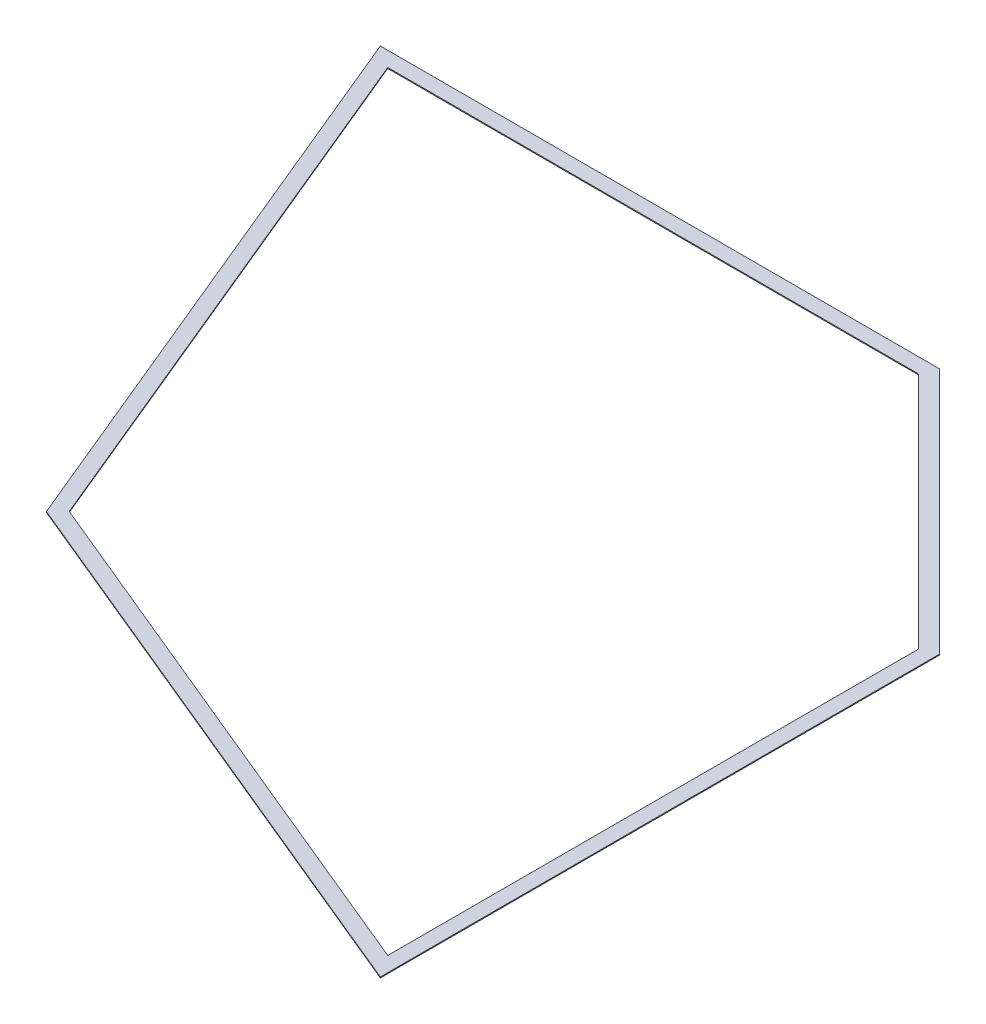
ISO-10303-21;
HEADER;
FILE_DESCRIPTION(('STEP AP214'),'2;1');
FILE_NAME('part.step','',(''),(''),'','','');
FILE_SCHEMA(('AUTOMOTIVE_DESIGN { 1 0 10303 214 1 1 1 1 }'));
ENDSEC;
DATA;
#1=APPLICATION_CONTEXT('core data for automotive mechanical design processes');
#2=APPLICATION_PROTOCOL_DEFINITION('international standard','automotive_design',2000,#1);
#3=PRODUCT_CONTEXT('',#1,'mechanical');
#4=PRODUCT('Part','Part','',(#3));
#5=PRODUCT_RELATED_PRODUCT_CATEGORY('part','',(#4));
#6=PRODUCT_DEFINITION_FORMATION('','',#4);
#7=PRODUCT_DEFINITION_CONTEXT('part definition',#1,'design');
#8=PRODUCT_DEFINITION('design','',#6,#7);
#9=PRODUCT_DEFINITION_SHAPE('','',#8);
#10=(LENGTH_UNIT() NAMED_UNIT(*) SI_UNIT(.MILLI.,.METRE.));
#11=(NAMED_UNIT(*) PLANE_ANGLE_UNIT() SI_UNIT($,.RADIAN.));
#12=(NAMED_UNIT(*) SI_UNIT($,.STERADIAN.) SOLID_ANGLE_UNIT());
#13=UNCERTAINTY_MEASURE_WITH_UNIT(LENGTH_MEASURE(1.E-05),#10,'distance_accuracy_value','');
#14=(GEOMETRIC_REPRESENTATION_CONTEXT(3) GLOBAL_UNCERTAINTY_ASSIGNED_CONTEXT((#13)) GLOBAL_UNIT_ASSIGNED_CONTEXT((#10,
#11,#12)) REPRESENTATION_CONTEXT('',''));
#15=CARTESIAN_POINT('',(0.,0.,0.));
#16=DIRECTION('',(0.,0.,1.));
#17=DIRECTION('',(1.,0.,0.));
#18=AXIS2_PLACEMENT_3D('',#15,#16,#17);
#19=CARTESIAN_POINT('',(0.,3.175,0.));
#20=DIRECTION('',(0.,-1.,0.));
#21=DIRECTION('',(0.,0.,-1.));
#22=AXIS2_PLACEMENT_3D('',#19,#20,#21);
#23=PLANE('',#22);
#24=DIRECTION('',(-1.,0.,0.));
#25=VECTOR('',#24,1.);
#26=CARTESIAN_POINT('',(-2936.30146633762,3.175,187.325));
#27=LINE('',#26,#25);
#28=CARTESIAN_POINT('',(-1029.49970440487,3.175,187.325));
#29=VERTEX_POINT('',#28);
#30=CARTESIAN_POINT('',(-2936.30146633762,3.175,187.325));
#31=VERTEX_POINT('',#30);
#32=EDGE_CURVE('E199',#29,#31,#27,.T.);
#33=ORIENTED_EDGE('',*,*,#32,.T.);
#34=DIRECTION('',(0.382683432365089,0.,0.923879532511287));
#35=VECTOR('',#34,1.);
#36=CARTESIAN_POINT('',(-2131.14490066957,3.175,2131.14490066957));
#37=LINE('',#36,#35);
#38=CARTESIAN_POINT('',(-2131.14490066957,3.175,2131.14490066957));
#39=VERTEX_POINT('',#38);
#40=EDGE_CURVE('E203',#31,#39,#37,.T.);
#41=ORIENTED_EDGE('',*,*,#40,.T.);
#42=DIRECTION('',(0.923879532511287,0.,0.38268343236509));
#43=VECTOR('',#42,1.);
#44=CARTESIAN_POINT('',(-187.325000000005,3.175,2936.30146633762));
#45=LINE('',#44,#43);
#46=CARTESIAN_POINT('',(-187.325000000005,3.175,2936.30146633762));
#47=VERTEX_POINT('',#46);
#48=EDGE_CURVE('E207',#39,#47,#45,.T.);
#49=ORIENTED_EDGE('',*,*,#48,.T.);
#50=DIRECTION('',(0.,0.,-1.));
#51=VECTOR('',#50,1.);
#52=CARTESIAN_POINT('',(-187.325000000005,3.175,1029.49970440487));
#53=LINE('',#52,#51);
#54=CARTESIAN_POINT('',(-187.325000000005,3.175,1029.49970440487));
#55=VERTEX_POINT('',#54);
#56=EDGE_CURVE('E210',#47,#55,#53,.T.);
#57=ORIENTED_EDGE('',*,*,#56,.T.);
#58=DIRECTION('',(-0.707106781186546,0.,-0.707106781186549));
#59=VECTOR('',#58,1.);
#60=CARTESIAN_POINT('',(-1029.49970440487,3.175,187.325));
#61=LINE('',#60,#59);
#62=EDGE_CURVE('E213',#55,#29,#61,.T.);
#63=ORIENTED_EDGE('',*,*,#62,.T.);
#64=EDGE_LOOP('',(#33,#41,#49,#57,#63));
#65=FACE_BOUND('',#64,.T.);
#66=DIRECTION('',(-0.707106781186546,0.,-0.707106781186549));
#67=VECTOR('',#66,1.);
#68=CARTESIAN_POINT('',(-1050.54175337342,3.175,238.125));
#69=LINE('',#68,#67);
#70=CARTESIAN_POINT('',(-238.125000000005,3.175,1050.54175337342));
#71=VERTEX_POINT('',#70);
#72=CARTESIAN_POINT('',(-1050.54175337342,3.175,238.125));
#73=VERTEX_POINT('',#72);
#74=EDGE_CURVE('E140',#71,#73,#69,.T.);
#75=ORIENTED_EDGE('',*,*,#74,.F.);
#76=DIRECTION('',(0.,0.,-1.));
#77=VECTOR('',#76,1.);
#78=CARTESIAN_POINT('',(-238.125000000005,3.175,1050.54175337342));
#79=LINE('',#78,#77);
#80=CARTESIAN_POINT('',(-238.125000000005,3.175,2860.27389359421));
#81=VERTEX_POINT('',#80);
#82=EDGE_CURVE('E173',#81,#71,#79,.T.);
#83=ORIENTED_EDGE('',*,*,#82,.F.);
#84=DIRECTION('',(0.923879532511287,0.,0.38268343236509));
#85=VECTOR('',#84,1.);
#86=CARTESIAN_POINT('',(-238.125000000005,3.175,2860.27389359421));
#87=LINE('',#86,#85);
#88=CARTESIAN_POINT('',(-2092.26426394128,3.175,2092.26426394127));
#89=VERTEX_POINT('',#88);
#90=EDGE_CURVE('E168',#89,#81,#87,.T.);
#91=ORIENTED_EDGE('',*,*,#90,.F.);
#92=DIRECTION('',(0.382683432365089,0.,0.923879532511287));
#93=VECTOR('',#92,1.);
#94=CARTESIAN_POINT('',(-2092.26426394128,3.175,2092.26426394127));
#95=LINE('',#94,#93);
#96=CARTESIAN_POINT('',(-2860.27389359422,3.175,238.125));
#97=VERTEX_POINT('',#96);
#98=EDGE_CURVE('E163',#97,#89,#95,.T.);
#99=ORIENTED_EDGE('',*,*,#98,.F.);
#100=DIRECTION('',(-1.,0.,0.));
#101=VECTOR('',#100,1.);
#102=CARTESIAN_POINT('',(-2860.27389359422,3.175,238.125));
#103=LINE('',#102,#101);
#104=EDGE_CURVE('E149',#73,#97,#103,.T.);
#105=ORIENTED_EDGE('',*,*,#104,.F.);
#106=EDGE_LOOP('',(#75,#83,#91,#99,#105));
#107=FACE_BOUND('',#106,.T.);
#108=ADVANCED_FACE('F42',(#65,#107),#23,.F.);
#109=CARTESIAN_POINT('',(0.,0.,0.));
#110=DIRECTION('',(0.,-1.,0.));
#111=DIRECTION('',(0.,0.,-1.));
#112=AXIS2_PLACEMENT_3D('',#109,#110,#111);
#113=PLANE('',#112);
#114=DIRECTION('',(-1.,0.,0.));
#115=VECTOR('',#114,1.);
#116=CARTESIAN_POINT('',(-2936.30146633762,0.,187.325));
#117=LINE('',#116,#115);
#118=CARTESIAN_POINT('',(-1029.49970440487,0.,187.325));
#119=VERTEX_POINT('',#118);
#120=CARTESIAN_POINT('',(-2936.30146633762,0.,187.325));
#121=VERTEX_POINT('',#120);
#122=EDGE_CURVE('E158',#119,#121,#117,.T.);
#123=ORIENTED_EDGE('',*,*,#122,.F.);
#124=DIRECTION('',(-0.707106781186546,0.,-0.707106781186549));
#125=VECTOR('',#124,1.);
#126=CARTESIAN_POINT('',(-1029.49970440487,0.,187.325));
#127=LINE('',#126,#125);
#128=CARTESIAN_POINT('',(-187.325000000005,0.,1029.49970440487));
#129=VERTEX_POINT('',#128);
#130=EDGE_CURVE('E204',#129,#119,#127,.T.);
#131=ORIENTED_EDGE('',*,*,#130,.F.);
#132=DIRECTION('',(0.,0.,-1.));
#133=VECTOR('',#132,1.);
#134=CARTESIAN_POINT('',(-187.325000000005,0.,1029.49970440487));
#135=LINE('',#134,#133);
#136=CARTESIAN_POINT('',(-187.325000000005,0.,2936.30146633762));
#137=VERTEX_POINT('',#136);
#138=EDGE_CURVE('E226',#137,#129,#135,.T.);
#139=ORIENTED_EDGE('',*,*,#138,.F.);
#140=DIRECTION('',(0.923879532511287,0.,0.38268343236509));
#141=VECTOR('',#140,1.);
#142=CARTESIAN_POINT('',(-187.325000000005,0.,2936.30146633762));
#143=LINE('',#142,#141);
#144=CARTESIAN_POINT('',(-2131.14490066957,0.,2131.14490066957));
#145=VERTEX_POINT('',#144);
#146=EDGE_CURVE('E223',#145,#137,#143,.T.);
#147=ORIENTED_EDGE('',*,*,#146,.F.);
#148=DIRECTION('',(0.382683432365089,0.,0.923879532511287));
#149=VECTOR('',#148,1.);
#150=CARTESIAN_POINT('',(-2131.14490066957,0.,2131.14490066957));
#151=LINE('',#150,#149);
#152=EDGE_CURVE('E220',#121,#145,#151,.T.);
#153=ORIENTED_EDGE('',*,*,#152,.F.);
#154=EDGE_LOOP('',(#123,#131,#139,#147,#153));
#155=FACE_BOUND('',#154,.T.);
#156=DIRECTION('',(0.,0.,-1.));
#157=VECTOR('',#156,1.);
#158=CARTESIAN_POINT('',(-238.125000000005,0.,1050.54175337342));
#159=LINE('',#158,#157);
#160=CARTESIAN_POINT('',(-238.125000000005,0.,2860.27389359421));
#161=VERTEX_POINT('',#160);
#162=CARTESIAN_POINT('',(-238.125000000005,0.,1050.54175337342));
#163=VERTEX_POINT('',#162);
#164=EDGE_CURVE('E150',#161,#163,#159,.T.);
#165=ORIENTED_EDGE('',*,*,#164,.T.);
#166=DIRECTION('',(-0.707106781186546,0.,-0.707106781186549));
#167=VECTOR('',#166,1.);
#168=CARTESIAN_POINT('',(-1050.54175337342,0.,238.125));
#169=LINE('',#168,#167);
#170=CARTESIAN_POINT('',(-1050.54175337342,0.,238.125));
#171=VERTEX_POINT('',#170);
#172=EDGE_CURVE('E72',#163,#171,#169,.T.);
#173=ORIENTED_EDGE('',*,*,#172,.T.);
#174=DIRECTION('',(-1.,0.,0.));
#175=VECTOR('',#174,1.);
#176=CARTESIAN_POINT('',(-2860.27389359422,0.,238.125));
#177=LINE('',#176,#175);
#178=CARTESIAN_POINT('',(-2860.27389359422,0.,238.125));
#179=VERTEX_POINT('',#178);
#180=EDGE_CURVE('E156',#171,#179,#177,.T.);
#181=ORIENTED_EDGE('',*,*,#180,.T.);
#182=DIRECTION('',(0.382683432365089,0.,0.923879532511287));
#183=VECTOR('',#182,1.);
#184=CARTESIAN_POINT('',(-2092.26426394128,0.,2092.26426394127));
#185=LINE('',#184,#183);
#186=CARTESIAN_POINT('',(-2092.26426394128,0.,2092.26426394127));
#187=VERTEX_POINT('',#186);
#188=EDGE_CURVE('E179',#179,#187,#185,.T.);
#189=ORIENTED_EDGE('',*,*,#188,.T.);
#190=DIRECTION('',(0.923879532511287,0.,0.38268343236509));
#191=VECTOR('',#190,1.);
#192=CARTESIAN_POINT('',(-238.125000000005,0.,2860.27389359421));
#193=LINE('',#192,#191);
#194=EDGE_CURVE('E183',#187,#161,#193,.T.);
#195=ORIENTED_EDGE('',*,*,#194,.T.);
#196=EDGE_LOOP('',(#165,#173,#181,#189,#195));
#197=FACE_BOUND('',#196,.T.);
#198=ADVANCED_FACE('F253',(#155,#197),#113,.T.);
#199=CARTESIAN_POINT('',(-2936.30146633762,3.175,187.325));
#200=DIRECTION('',(0.,0.,1.));
#201=DIRECTION('',(1.,0.,0.));
#202=AXIS2_PLACEMENT_3D('',#199,#200,#201);
#203=PLANE('',#202);
#204=ORIENTED_EDGE('',*,*,#122,.T.);
#205=DIRECTION('',(0.,-1.,0.));
#206=VECTOR('',#205,1.);
#207=CARTESIAN_POINT('',(-2936.30146633762,3.175,187.325));
#208=LINE('',#207,#206);
#209=EDGE_CURVE('E11',#31,#121,#208,.T.);
#210=ORIENTED_EDGE('',*,*,#209,.F.);
#211=ORIENTED_EDGE('',*,*,#32,.F.);
#212=DIRECTION('',(0.,-1.,0.));
#213=VECTOR('',#212,1.);
#214=CARTESIAN_POINT('',(-1029.49970440487,3.175,187.325));
#215=LINE('',#214,#213);
#216=EDGE_CURVE('E216',#29,#119,#215,.T.);
#217=ORIENTED_EDGE('',*,*,#216,.T.);
#218=EDGE_LOOP('',(#204,#210,#211,#217));
#219=FACE_BOUND('',#218,.T.);
#220=ADVANCED_FACE('F44',(#219),#203,.F.);
#221=CARTESIAN_POINT('',(-2131.14490066957,3.175,2131.14490066957));
#222=DIRECTION('',(0.923879532511287,0.,-0.382683432365089));
#223=DIRECTION('',(-0.382683432365089,0.,-0.923879532511287));
#224=AXIS2_PLACEMENT_3D('',#221,#222,#223);
#225=PLANE('',#224);
#226=ORIENTED_EDGE('',*,*,#152,.T.);
#227=DIRECTION('',(0.,-1.,0.));
#228=VECTOR('',#227,1.);
#229=CARTESIAN_POINT('',(-2131.14490066957,3.175,2131.14490066957));
#230=LINE('',#229,#228);
#231=EDGE_CURVE('E51',#39,#145,#230,.T.);
#232=ORIENTED_EDGE('',*,*,#231,.F.);
#233=ORIENTED_EDGE('',*,*,#40,.F.);
#234=ORIENTED_EDGE('',*,*,#209,.T.);
#235=EDGE_LOOP('',(#226,#232,#233,#234));
#236=FACE_BOUND('',#235,.T.);
#237=ADVANCED_FACE('F267',(#236),#225,.F.);
#238=CARTESIAN_POINT('',(-187.325000000005,3.175,2936.30146633762));
#239=DIRECTION('',(0.382683432365089,0.,-0.923879532511287));
#240=DIRECTION('',(-0.923879532511287,0.,-0.382683432365089));
#241=AXIS2_PLACEMENT_3D('',#238,#239,#240);
#242=PLANE('',#241);
#243=ORIENTED_EDGE('',*,*,#146,.T.);
#244=DIRECTION('',(0.,-1.,0.));
#245=VECTOR('',#244,1.);
#246=CARTESIAN_POINT('',(-187.325000000005,3.175,2936.30146633762));
#247=LINE('',#246,#245);
#248=EDGE_CURVE('E238',#47,#137,#247,.T.);
#249=ORIENTED_EDGE('',*,*,#248,.F.);
#250=ORIENTED_EDGE('',*,*,#48,.F.);
#251=ORIENTED_EDGE('',*,*,#231,.T.);
#252=EDGE_LOOP('',(#243,#249,#250,#251));
#253=FACE_BOUND('',#252,.T.);
#254=ADVANCED_FACE('F247',(#253),#242,.F.);
#255=CARTESIAN_POINT('',(-187.325000000005,3.175,1029.49970440487));
#256=DIRECTION('',(-1.,0.,0.));
#257=DIRECTION('',(0.,0.,1.));
#258=AXIS2_PLACEMENT_3D('',#255,#256,#257);
#259=PLANE('',#258);
#260=ORIENTED_EDGE('',*,*,#138,.T.);
#261=DIRECTION('',(0.,-1.,0.));
#262=VECTOR('',#261,1.);
#263=CARTESIAN_POINT('',(-187.325000000005,3.175,1029.49970440487));
#264=LINE('',#263,#262);
#265=EDGE_CURVE('E234',#55,#129,#264,.T.);
#266=ORIENTED_EDGE('',*,*,#265,.F.);
#267=ORIENTED_EDGE('',*,*,#56,.F.);
#268=ORIENTED_EDGE('',*,*,#248,.T.);
#269=EDGE_LOOP('',(#260,#266,#267,#268));
#270=FACE_BOUND('',#269,.T.);
#271=ADVANCED_FACE('F258',(#270),#259,.F.);
#272=CARTESIAN_POINT('',(-1029.49970440487,3.175,187.325));
#273=DIRECTION('',(-0.707106781186549,0.,0.707106781186546));
#274=DIRECTION('',(0.707106781186546,0.,0.707106781186549));
#275=AXIS2_PLACEMENT_3D('',#272,#273,#274);
#276=PLANE('',#275);
#277=ORIENTED_EDGE('',*,*,#130,.T.);
#278=ORIENTED_EDGE('',*,*,#216,.F.);
#279=ORIENTED_EDGE('',*,*,#62,.F.);
#280=ORIENTED_EDGE('',*,*,#265,.T.);
#281=EDGE_LOOP('',(#277,#278,#279,#280));
#282=FACE_BOUND('',#281,.T.);
#283=ADVANCED_FACE('F262',(#282),#276,.F.);
#284=CARTESIAN_POINT('',(-1050.54175337342,3.175,238.125));
#285=DIRECTION('',(-0.707106781186548,0.,0.707106781186546));
#286=DIRECTION('',(0.707106781186547,0.,0.707106781186549));
#287=AXIS2_PLACEMENT_3D('',#284,#285,#286);
#288=PLANE('',#287);
#289=ORIENTED_EDGE('',*,*,#172,.F.);
#290=DIRECTION('',(0.,-1.,0.));
#291=VECTOR('',#290,1.);
#292=CARTESIAN_POINT('',(-238.125000000005,3.175,1050.54175337342));
#293=LINE('',#292,#291);
#294=EDGE_CURVE('E144',#71,#163,#293,.T.);
#295=ORIENTED_EDGE('',*,*,#294,.F.);
#296=ORIENTED_EDGE('',*,*,#74,.T.);
#297=DIRECTION('',(0.,-1.,0.));
#298=VECTOR('',#297,1.);
#299=CARTESIAN_POINT('',(-1050.54175337342,3.175,238.125));
#300=LINE('',#299,#298);
#301=EDGE_CURVE('E143',#73,#171,#300,.T.);
#302=ORIENTED_EDGE('',*,*,#301,.T.);
#303=EDGE_LOOP('',(#289,#295,#296,#302));
#304=FACE_BOUND('',#303,.T.);
#305=ADVANCED_FACE('F142',(#304),#288,.T.);
#306=CARTESIAN_POINT('',(-2860.27389359422,3.175,238.125));
#307=DIRECTION('',(0.,0.,1.));
#308=DIRECTION('',(1.,0.,0.));
#309=AXIS2_PLACEMENT_3D('',#306,#307,#308);
#310=PLANE('',#309);
#311=ORIENTED_EDGE('',*,*,#180,.F.);
#312=ORIENTED_EDGE('',*,*,#301,.F.);
#313=ORIENTED_EDGE('',*,*,#104,.T.);
#314=DIRECTION('',(0.,-1.,0.));
#315=VECTOR('',#314,1.);
#316=CARTESIAN_POINT('',(-2860.27389359422,3.175,238.125));
#317=LINE('',#316,#315);
#318=EDGE_CURVE('E159',#97,#179,#317,.T.);
#319=ORIENTED_EDGE('',*,*,#318,.T.);
#320=EDGE_LOOP('',(#311,#312,#313,#319));
#321=FACE_BOUND('',#320,.T.);
#322=ADVANCED_FACE('F153',(#321),#310,.T.);
#323=CARTESIAN_POINT('',(-2092.26426394128,3.175,2092.26426394127));
#324=DIRECTION('',(0.923879532511287,0.,-0.382683432365089));
#325=DIRECTION('',(-0.382683432365089,0.,-0.923879532511287));
#326=AXIS2_PLACEMENT_3D('',#323,#324,#325);
#327=PLANE('',#326);
#328=ORIENTED_EDGE('',*,*,#188,.F.);
#329=ORIENTED_EDGE('',*,*,#318,.F.);
#330=ORIENTED_EDGE('',*,*,#98,.T.);
#331=DIRECTION('',(0.,-1.,0.));
#332=VECTOR('',#331,1.);
#333=CARTESIAN_POINT('',(-2092.26426394128,3.175,2092.26426394127));
#334=LINE('',#333,#332);
#335=EDGE_CURVE('E194',#89,#187,#334,.T.);
#336=ORIENTED_EDGE('',*,*,#335,.T.);
#337=EDGE_LOOP('',(#328,#329,#330,#336));
#338=FACE_BOUND('',#337,.T.);
#339=ADVANCED_FACE('F310',(#338),#327,.T.);
#340=CARTESIAN_POINT('',(-238.125000000005,3.175,2860.27389359421));
#341=DIRECTION('',(0.38268343236509,0.,-0.923879532511287));
#342=DIRECTION('',(-0.923879532511287,0.,-0.38268343236509));
#343=AXIS2_PLACEMENT_3D('',#340,#341,#342);
#344=PLANE('',#343);
#345=ORIENTED_EDGE('',*,*,#194,.F.);
#346=ORIENTED_EDGE('',*,*,#335,.F.);
#347=ORIENTED_EDGE('',*,*,#90,.T.);
#348=DIRECTION('',(0.,-1.,0.));
#349=VECTOR('',#348,1.);
#350=CARTESIAN_POINT('',(-238.125000000005,3.175,2860.27389359421));
#351=LINE('',#350,#349);
#352=EDGE_CURVE('E61',#81,#161,#351,.T.);
#353=ORIENTED_EDGE('',*,*,#352,.T.);
#354=EDGE_LOOP('',(#345,#346,#347,#353));
#355=FACE_BOUND('',#354,.T.);
#356=ADVANCED_FACE('F316',(#355),#344,.T.);
#357=CARTESIAN_POINT('',(-238.125000000005,3.175,1050.54175337342));
#358=DIRECTION('',(-1.,0.,0.));
#359=DIRECTION('',(0.,0.,1.));
#360=AXIS2_PLACEMENT_3D('',#357,#358,#359);
#361=PLANE('',#360);
#362=ORIENTED_EDGE('',*,*,#164,.F.);
#363=ORIENTED_EDGE('',*,*,#352,.F.);
#364=ORIENTED_EDGE('',*,*,#82,.T.);
#365=ORIENTED_EDGE('',*,*,#294,.T.);
#366=EDGE_LOOP('',(#362,#363,#364,#365));
#367=FACE_BOUND('',#366,.T.);
#368=ADVANCED_FACE('F324',(#367),#361,.T.);
#369=CLOSED_SHELL('',(#108,#198,#220,#237,#254,#271,#283,#305,#322,#339,#356,#368));
#370=MANIFOLD_SOLID_BREP('B2',#369);
#371=ADVANCED_BREP_SHAPE_REPRESENTATION('',(#18,#370),#14);
#372=SHAPE_DEFINITION_REPRESENTATION(#9,#371);
ENDSEC;
END-ISO-10303-21;
